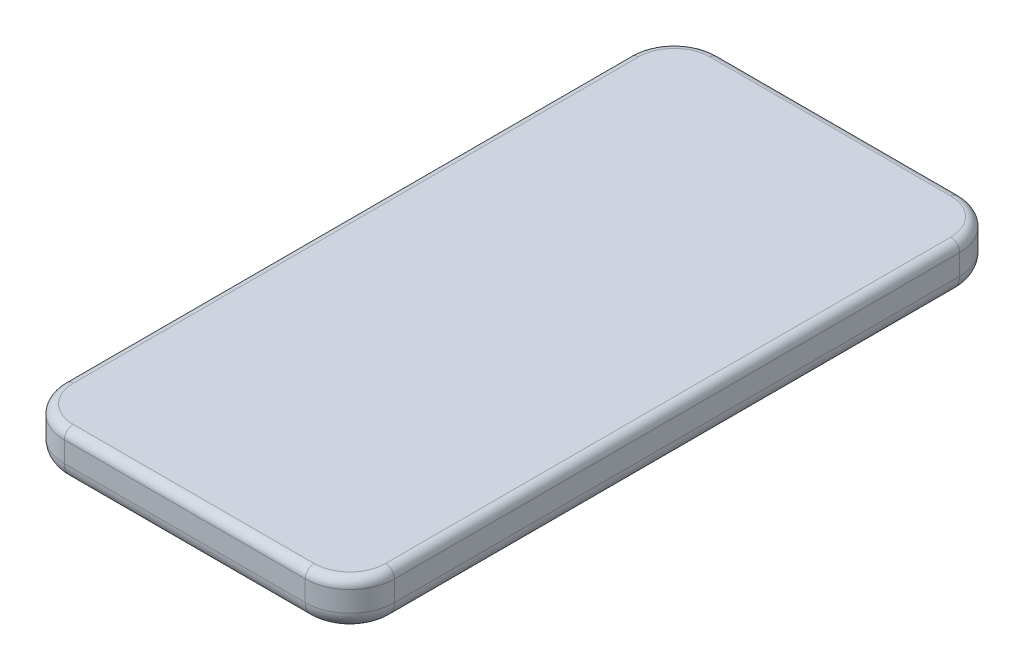
ISO-10303-21;
HEADER;
FILE_DESCRIPTION(('STEP AP214'),'2;1');
FILE_NAME('part.step','',(''),(''),'','','');
FILE_SCHEMA(('AUTOMOTIVE_DESIGN { 1 0 10303 214 1 1 1 1 }'));
ENDSEC;
DATA;
#1=APPLICATION_CONTEXT('core data for automotive mechanical design processes');
#2=APPLICATION_PROTOCOL_DEFINITION('international standard','automotive_design',2000,#1);
#3=PRODUCT_CONTEXT('',#1,'mechanical');
#4=PRODUCT('Part','Part','',(#3));
#5=PRODUCT_RELATED_PRODUCT_CATEGORY('part','',(#4));
#6=PRODUCT_DEFINITION_FORMATION('','',#4);
#7=PRODUCT_DEFINITION_CONTEXT('part definition',#1,'design');
#8=PRODUCT_DEFINITION('design','',#6,#7);
#9=PRODUCT_DEFINITION_SHAPE('','',#8);
#10=(LENGTH_UNIT() NAMED_UNIT(*) SI_UNIT(.MILLI.,.METRE.));
#11=(NAMED_UNIT(*) PLANE_ANGLE_UNIT() SI_UNIT($,.RADIAN.));
#12=(NAMED_UNIT(*) SI_UNIT($,.STERADIAN.) SOLID_ANGLE_UNIT());
#13=UNCERTAINTY_MEASURE_WITH_UNIT(LENGTH_MEASURE(1.E-05),#10,'distance_accuracy_value','');
#14=(GEOMETRIC_REPRESENTATION_CONTEXT(3) GLOBAL_UNCERTAINTY_ASSIGNED_CONTEXT((#13)) GLOBAL_UNIT_ASSIGNED_CONTEXT((#10,
#11,#12)) REPRESENTATION_CONTEXT('',''));
#15=CARTESIAN_POINT('',(0.,0.,0.));
#16=DIRECTION('',(0.,0.,1.));
#17=DIRECTION('',(1.,0.,0.));
#18=AXIS2_PLACEMENT_3D('',#15,#16,#17);
#19=CARTESIAN_POINT('',(-37.,10.6,146.7));
#20=DIRECTION('',(1.,0.,0.));
#21=DIRECTION('',(0.,0.,-1.));
#22=AXIS2_PLACEMENT_3D('',#19,#20,#21);
#23=PLANE('',#22);
#24=DIRECTION('',(0.,-1.,0.));
#25=VECTOR('',#24,1.);
#26=CARTESIAN_POINT('',(-37.,10.6,136.7));
#27=LINE('',#26,#25);
#28=CARTESIAN_POINT('',(-37.,4.,136.7));
#29=VERTEX_POINT('',#28);
#30=CARTESIAN_POINT('',(-37.,8.6,136.7));
#31=VERTEX_POINT('',#30);
#32=EDGE_CURVE('E307',#29,#31,#27,.F.);
#33=ORIENTED_EDGE('',*,*,#32,.T.);
#34=DIRECTION('',(0.,0.,1.));
#35=VECTOR('',#34,1.);
#36=CARTESIAN_POINT('',(-37.,8.6,146.7));
#37=LINE('',#36,#35);
#38=CARTESIAN_POINT('',(-37.,8.6,10.));
#39=VERTEX_POINT('',#38);
#40=EDGE_CURVE('E247',#31,#39,#37,.F.);
#41=ORIENTED_EDGE('',*,*,#40,.T.);
#42=DIRECTION('',(0.,-1.,0.));
#43=VECTOR('',#42,1.);
#44=CARTESIAN_POINT('',(-37.,10.6,10.));
#45=LINE('',#44,#43);
#46=CARTESIAN_POINT('',(-37.,4.,10.));
#47=VERTEX_POINT('',#46);
#48=EDGE_CURVE('E305',#39,#47,#45,.T.);
#49=ORIENTED_EDGE('',*,*,#48,.T.);
#50=DIRECTION('',(0.,0.,1.));
#51=VECTOR('',#50,1.);
#52=CARTESIAN_POINT('',(-37.,4.,136.7));
#53=LINE('',#52,#51);
#54=EDGE_CURVE('E212',#47,#29,#53,.T.);
#55=ORIENTED_EDGE('',*,*,#54,.T.);
#56=EDGE_LOOP('',(#33,#41,#49,#55));
#57=FACE_BOUND('',#56,.T.);
#58=ADVANCED_FACE('F36',(#57),#23,.F.);
#59=CARTESIAN_POINT('',(37.,10.6,146.7));
#60=DIRECTION('',(0.,0.,-1.));
#61=DIRECTION('',(-1.,0.,0.));
#62=AXIS2_PLACEMENT_3D('',#59,#60,#61);
#63=PLANE('',#62);
#64=DIRECTION('',(0.,-1.,0.));
#65=VECTOR('',#64,1.);
#66=CARTESIAN_POINT('',(27.,10.6,146.7));
#67=LINE('',#66,#65);
#68=CARTESIAN_POINT('',(27.,4.,146.7));
#69=VERTEX_POINT('',#68);
#70=CARTESIAN_POINT('',(27.,8.6,146.7));
#71=VERTEX_POINT('',#70);
#72=EDGE_CURVE('E300',#69,#71,#67,.F.);
#73=ORIENTED_EDGE('',*,*,#72,.T.);
#74=DIRECTION('',(1.,0.,0.));
#75=VECTOR('',#74,1.);
#76=CARTESIAN_POINT('',(37.,8.6,146.7));
#77=LINE('',#76,#75);
#78=CARTESIAN_POINT('',(-27.,8.6,146.7));
#79=VERTEX_POINT('',#78);
#80=EDGE_CURVE('E45',#71,#79,#77,.F.);
#81=ORIENTED_EDGE('',*,*,#80,.T.);
#82=DIRECTION('',(0.,-1.,0.));
#83=VECTOR('',#82,1.);
#84=CARTESIAN_POINT('',(-27.,10.6,146.7));
#85=LINE('',#84,#83);
#86=CARTESIAN_POINT('',(-27.,4.,146.7));
#87=VERTEX_POINT('',#86);
#88=EDGE_CURVE('E298',#79,#87,#85,.T.);
#89=ORIENTED_EDGE('',*,*,#88,.T.);
#90=DIRECTION('',(1.,0.,0.));
#91=VECTOR('',#90,1.);
#92=CARTESIAN_POINT('',(27.,4.,146.7));
#93=LINE('',#92,#91);
#94=EDGE_CURVE('E209',#87,#69,#93,.T.);
#95=ORIENTED_EDGE('',*,*,#94,.T.);
#96=EDGE_LOOP('',(#73,#81,#89,#95));
#97=FACE_BOUND('',#96,.T.);
#98=ADVANCED_FACE('F371',(#97),#63,.F.);
#99=CARTESIAN_POINT('',(37.,10.6,0.));
#100=DIRECTION('',(-1.,0.,0.));
#101=DIRECTION('',(0.,0.,1.));
#102=AXIS2_PLACEMENT_3D('',#99,#100,#101);
#103=PLANE('',#102);
#104=DIRECTION('',(0.,-1.,0.));
#105=VECTOR('',#104,1.);
#106=CARTESIAN_POINT('',(37.,10.6,10.));
#107=LINE('',#106,#105);
#108=CARTESIAN_POINT('',(37.,4.,10.));
#109=VERTEX_POINT('',#108);
#110=CARTESIAN_POINT('',(37.,8.6,10.));
#111=VERTEX_POINT('',#110);
#112=EDGE_CURVE('E230',#109,#111,#107,.F.);
#113=ORIENTED_EDGE('',*,*,#112,.T.);
#114=DIRECTION('',(0.,0.,-1.));
#115=VECTOR('',#114,1.);
#116=CARTESIAN_POINT('',(37.,8.6,0.));
#117=LINE('',#116,#115);
#118=CARTESIAN_POINT('',(37.,8.6,136.7));
#119=VERTEX_POINT('',#118);
#120=EDGE_CURVE('E256',#111,#119,#117,.F.);
#121=ORIENTED_EDGE('',*,*,#120,.T.);
#122=DIRECTION('',(0.,-1.,0.));
#123=VECTOR('',#122,1.);
#124=CARTESIAN_POINT('',(37.,10.6,136.7));
#125=LINE('',#124,#123);
#126=CARTESIAN_POINT('',(37.,4.,136.7));
#127=VERTEX_POINT('',#126);
#128=EDGE_CURVE('E293',#119,#127,#125,.T.);
#129=ORIENTED_EDGE('',*,*,#128,.T.);
#130=DIRECTION('',(0.,0.,-1.));
#131=VECTOR('',#130,1.);
#132=CARTESIAN_POINT('',(37.,4.,10.));
#133=LINE('',#132,#131);
#134=EDGE_CURVE('E204',#127,#109,#133,.T.);
#135=ORIENTED_EDGE('',*,*,#134,.T.);
#136=EDGE_LOOP('',(#113,#121,#129,#135));
#137=FACE_BOUND('',#136,.T.);
#138=ADVANCED_FACE('F292',(#137),#103,.F.);
#139=CARTESIAN_POINT('',(-37.,10.6,0.));
#140=DIRECTION('',(0.,0.,1.));
#141=DIRECTION('',(1.,0.,0.));
#142=AXIS2_PLACEMENT_3D('',#139,#140,#141);
#143=PLANE('',#142);
#144=DIRECTION('',(0.,-1.,0.));
#145=VECTOR('',#144,1.);
#146=CARTESIAN_POINT('',(-27.,10.6,0.));
#147=LINE('',#146,#145);
#148=CARTESIAN_POINT('',(-27.,4.,0.));
#149=VERTEX_POINT('',#148);
#150=CARTESIAN_POINT('',(-27.,8.6,0.));
#151=VERTEX_POINT('',#150);
#152=EDGE_CURVE('E178',#149,#151,#147,.F.);
#153=ORIENTED_EDGE('',*,*,#152,.T.);
#154=DIRECTION('',(-1.,0.,0.));
#155=VECTOR('',#154,1.);
#156=CARTESIAN_POINT('',(-37.,8.6,0.));
#157=LINE('',#156,#155);
#158=CARTESIAN_POINT('',(27.,8.6,0.));
#159=VERTEX_POINT('',#158);
#160=EDGE_CURVE('E252',#151,#159,#157,.F.);
#161=ORIENTED_EDGE('',*,*,#160,.T.);
#162=DIRECTION('',(0.,-1.,0.));
#163=VECTOR('',#162,1.);
#164=CARTESIAN_POINT('',(27.,10.6,0.));
#165=LINE('',#164,#163);
#166=CARTESIAN_POINT('',(27.,4.,0.));
#167=VERTEX_POINT('',#166);
#168=EDGE_CURVE('E181',#159,#167,#165,.T.);
#169=ORIENTED_EDGE('',*,*,#168,.T.);
#170=DIRECTION('',(-1.,0.,0.));
#171=VECTOR('',#170,1.);
#172=CARTESIAN_POINT('',(-27.,4.,0.));
#173=LINE('',#172,#171);
#174=EDGE_CURVE('E199',#167,#149,#173,.T.);
#175=ORIENTED_EDGE('',*,*,#174,.T.);
#176=EDGE_LOOP('',(#153,#161,#169,#175));
#177=FACE_BOUND('',#176,.T.);
#178=ADVANCED_FACE('F311',(#177),#143,.F.);
#179=CARTESIAN_POINT('',(0.,10.6,0.));
#180=DIRECTION('',(0.,-1.,0.));
#181=DIRECTION('',(0.,0.,-1.));
#182=AXIS2_PLACEMENT_3D('',#179,#180,#181);
#183=PLANE('',#182);
#184=CARTESIAN_POINT('',(-27.,10.6,10.));
#185=DIRECTION('',(0.,-1.,0.));
#186=DIRECTION('',(0.,0.,-1.));
#187=AXIS2_PLACEMENT_3D('',#184,#185,#186);
#188=CIRCLE('',#187,8.);
#189=CARTESIAN_POINT('',(-27.,10.6,2.));
#190=VERTEX_POINT('',#189);
#191=CARTESIAN_POINT('',(-35.,10.6,10.));
#192=VERTEX_POINT('',#191);
#193=EDGE_CURVE('E242',#190,#192,#188,.F.);
#194=ORIENTED_EDGE('',*,*,#193,.T.);
#195=DIRECTION('',(0.,0.,1.));
#196=VECTOR('',#195,1.);
#197=CARTESIAN_POINT('',(-35.,10.6,0.));
#198=LINE('',#197,#196);
#199=CARTESIAN_POINT('',(-35.,10.6,136.7));
#200=VERTEX_POINT('',#199);
#201=EDGE_CURVE('E244',#192,#200,#198,.T.);
#202=ORIENTED_EDGE('',*,*,#201,.T.);
#203=CARTESIAN_POINT('',(-27.,10.6,136.7));
#204=DIRECTION('',(0.,-1.,0.));
#205=DIRECTION('',(0.,0.,-1.));
#206=AXIS2_PLACEMENT_3D('',#203,#204,#205);
#207=CIRCLE('',#206,8.);
#208=CARTESIAN_POINT('',(-27.,10.6,144.7));
#209=VERTEX_POINT('',#208);
#210=EDGE_CURVE('E214',#200,#209,#207,.F.);
#211=ORIENTED_EDGE('',*,*,#210,.T.);
#212=DIRECTION('',(1.,0.,0.));
#213=VECTOR('',#212,1.);
#214=CARTESIAN_POINT('',(0.,10.6,144.7));
#215=LINE('',#214,#213);
#216=CARTESIAN_POINT('',(27.,10.6,144.7));
#217=VERTEX_POINT('',#216);
#218=EDGE_CURVE('E232',#209,#217,#215,.T.);
#219=ORIENTED_EDGE('',*,*,#218,.T.);
#220=CARTESIAN_POINT('',(27.,10.6,136.7));
#221=DIRECTION('',(0.,-1.,0.));
#222=DIRECTION('',(0.,0.,-1.));
#223=AXIS2_PLACEMENT_3D('',#220,#221,#222);
#224=CIRCLE('',#223,8.);
#225=CARTESIAN_POINT('',(35.,10.6,136.7));
#226=VERTEX_POINT('',#225);
#227=EDGE_CURVE('E234',#217,#226,#224,.F.);
#228=ORIENTED_EDGE('',*,*,#227,.T.);
#229=DIRECTION('',(0.,0.,-1.));
#230=VECTOR('',#229,1.);
#231=CARTESIAN_POINT('',(35.,10.6,0.));
#232=LINE('',#231,#230);
#233=CARTESIAN_POINT('',(35.,10.6,10.));
#234=VERTEX_POINT('',#233);
#235=EDGE_CURVE('E236',#226,#234,#232,.T.);
#236=ORIENTED_EDGE('',*,*,#235,.T.);
#237=CARTESIAN_POINT('',(27.,10.6,10.));
#238=DIRECTION('',(0.,-1.,0.));
#239=DIRECTION('',(0.,0.,-1.));
#240=AXIS2_PLACEMENT_3D('',#237,#238,#239);
#241=CIRCLE('',#240,8.);
#242=CARTESIAN_POINT('',(27.,10.6,2.));
#243=VERTEX_POINT('',#242);
#244=EDGE_CURVE('E238',#234,#243,#241,.F.);
#245=ORIENTED_EDGE('',*,*,#244,.T.);
#246=DIRECTION('',(-1.,0.,0.));
#247=VECTOR('',#246,1.);
#248=CARTESIAN_POINT('',(0.,10.6,2.));
#249=LINE('',#248,#247);
#250=EDGE_CURVE('E240',#243,#190,#249,.T.);
#251=ORIENTED_EDGE('',*,*,#250,.T.);
#252=EDGE_LOOP('',(#194,#202,#211,#219,#228,#236,#245,#251));
#253=FACE_BOUND('',#252,.T.);
#254=ADVANCED_FACE('F344',(#253),#183,.F.);
#255=CARTESIAN_POINT('',(0.,0.,0.));
#256=DIRECTION('',(0.,-1.,0.));
#257=DIRECTION('',(0.,0.,-1.));
#258=AXIS2_PLACEMENT_3D('',#255,#256,#257);
#259=PLANE('',#258);
#260=DIRECTION('',(0.,0.,1.));
#261=VECTOR('',#260,1.);
#262=CARTESIAN_POINT('',(-33.,0.,10.));
#263=LINE('',#262,#261);
#264=CARTESIAN_POINT('',(-33.,0.,136.7));
#265=VERTEX_POINT('',#264);
#266=CARTESIAN_POINT('',(-33.,0.,10.));
#267=VERTEX_POINT('',#266);
#268=EDGE_CURVE('E155',#265,#267,#263,.F.);
#269=ORIENTED_EDGE('',*,*,#268,.T.);
#270=CARTESIAN_POINT('',(-27.,0.,10.));
#271=DIRECTION('',(0.,-1.,0.));
#272=DIRECTION('',(0.,0.,-1.));
#273=AXIS2_PLACEMENT_3D('',#270,#271,#272);
#274=CIRCLE('',#273,6.);
#275=CARTESIAN_POINT('',(-27.,0.,4.));
#276=VERTEX_POINT('',#275);
#277=EDGE_CURVE('E194',#267,#276,#274,.T.);
#278=ORIENTED_EDGE('',*,*,#277,.T.);
#279=DIRECTION('',(-1.,0.,0.));
#280=VECTOR('',#279,1.);
#281=CARTESIAN_POINT('',(27.,0.,4.));
#282=LINE('',#281,#280);
#283=CARTESIAN_POINT('',(27.,0.,4.));
#284=VERTEX_POINT('',#283);
#285=EDGE_CURVE('E192',#276,#284,#282,.F.);
#286=ORIENTED_EDGE('',*,*,#285,.T.);
#287=CARTESIAN_POINT('',(27.,0.,10.));
#288=DIRECTION('',(0.,-1.,0.));
#289=DIRECTION('',(0.,0.,-1.));
#290=AXIS2_PLACEMENT_3D('',#287,#288,#289);
#291=CIRCLE('',#290,6.);
#292=CARTESIAN_POINT('',(33.,0.,10.));
#293=VERTEX_POINT('',#292);
#294=EDGE_CURVE('E190',#284,#293,#291,.T.);
#295=ORIENTED_EDGE('',*,*,#294,.T.);
#296=DIRECTION('',(0.,0.,-1.));
#297=VECTOR('',#296,1.);
#298=CARTESIAN_POINT('',(33.,0.,136.7));
#299=LINE('',#298,#297);
#300=CARTESIAN_POINT('',(33.,0.,136.7));
#301=VERTEX_POINT('',#300);
#302=EDGE_CURVE('E188',#293,#301,#299,.F.);
#303=ORIENTED_EDGE('',*,*,#302,.T.);
#304=CARTESIAN_POINT('',(27.,0.,136.7));
#305=DIRECTION('',(0.,-1.,0.));
#306=DIRECTION('',(0.,0.,-1.));
#307=AXIS2_PLACEMENT_3D('',#304,#305,#306);
#308=CIRCLE('',#307,6.);
#309=CARTESIAN_POINT('',(27.,0.,142.7));
#310=VERTEX_POINT('',#309);
#311=EDGE_CURVE('E186',#301,#310,#308,.T.);
#312=ORIENTED_EDGE('',*,*,#311,.T.);
#313=DIRECTION('',(1.,0.,0.));
#314=VECTOR('',#313,1.);
#315=CARTESIAN_POINT('',(-27.,0.,142.7));
#316=LINE('',#315,#314);
#317=CARTESIAN_POINT('',(-27.,0.,142.7));
#318=VERTEX_POINT('',#317);
#319=EDGE_CURVE('E158',#310,#318,#316,.F.);
#320=ORIENTED_EDGE('',*,*,#319,.T.);
#321=CARTESIAN_POINT('',(-27.,0.,136.7));
#322=DIRECTION('',(0.,-1.,0.));
#323=DIRECTION('',(0.,0.,-1.));
#324=AXIS2_PLACEMENT_3D('',#321,#322,#323);
#325=CIRCLE('',#324,6.);
#326=EDGE_CURVE('E150',#318,#265,#325,.T.);
#327=ORIENTED_EDGE('',*,*,#326,.T.);
#328=EDGE_LOOP('',(#269,#278,#286,#295,#303,#312,#320,#327));
#329=FACE_BOUND('',#328,.T.);
#330=ADVANCED_FACE('F152',(#329),#259,.T.);
#331=CARTESIAN_POINT('',(27.,10.6,136.7));
#332=DIRECTION('',(0.,-1.,0.));
#333=DIRECTION('',(0.,0.,-1.));
#334=AXIS2_PLACEMENT_3D('',#331,#332,#333);
#335=CYLINDRICAL_SURFACE('',#334,10.);
#336=ORIENTED_EDGE('',*,*,#128,.F.);
#337=CARTESIAN_POINT('',(27.,8.6,136.7));
#338=DIRECTION('',(0.,-1.,0.));
#339=DIRECTION('',(0.,0.,-1.));
#340=AXIS2_PLACEMENT_3D('',#337,#338,#339);
#341=CIRCLE('',#340,10.);
#342=EDGE_CURVE('E60',#119,#71,#341,.T.);
#343=ORIENTED_EDGE('',*,*,#342,.T.);
#344=ORIENTED_EDGE('',*,*,#72,.F.);
#345=CARTESIAN_POINT('',(27.,4.,136.7));
#346=DIRECTION('',(0.,-1.,0.));
#347=DIRECTION('',(0.,0.,-1.));
#348=AXIS2_PLACEMENT_3D('',#345,#346,#347);
#349=CIRCLE('',#348,10.);
#350=EDGE_CURVE('E206',#69,#127,#349,.F.);
#351=ORIENTED_EDGE('',*,*,#350,.T.);
#352=EDGE_LOOP('',(#336,#343,#344,#351));
#353=FACE_BOUND('',#352,.T.);
#354=ADVANCED_FACE('F295',(#353),#335,.T.);
#355=CARTESIAN_POINT('',(-27.,10.6,136.7));
#356=DIRECTION('',(0.,-1.,0.));
#357=DIRECTION('',(0.,0.,-1.));
#358=AXIS2_PLACEMENT_3D('',#355,#356,#357);
#359=CYLINDRICAL_SURFACE('',#358,10.);
#360=ORIENTED_EDGE('',*,*,#88,.F.);
#361=CARTESIAN_POINT('',(-27.,8.6,136.7));
#362=DIRECTION('',(0.,-1.,0.));
#363=DIRECTION('',(0.,0.,-1.));
#364=AXIS2_PLACEMENT_3D('',#361,#362,#363);
#365=CIRCLE('',#364,10.);
#366=EDGE_CURVE('E11',#79,#31,#365,.T.);
#367=ORIENTED_EDGE('',*,*,#366,.T.);
#368=ORIENTED_EDGE('',*,*,#32,.F.);
#369=CARTESIAN_POINT('',(-27.,4.,136.7));
#370=DIRECTION('',(0.,-1.,0.));
#371=DIRECTION('',(0.,0.,-1.));
#372=AXIS2_PLACEMENT_3D('',#369,#370,#371);
#373=CIRCLE('',#372,10.);
#374=EDGE_CURVE('E168',#29,#87,#373,.F.);
#375=ORIENTED_EDGE('',*,*,#374,.T.);
#376=EDGE_LOOP('',(#360,#367,#368,#375));
#377=FACE_BOUND('',#376,.T.);
#378=ADVANCED_FACE('F358',(#377),#359,.T.);
#379=CARTESIAN_POINT('',(-27.,10.6,10.));
#380=DIRECTION('',(0.,-1.,0.));
#381=DIRECTION('',(0.,0.,-1.));
#382=AXIS2_PLACEMENT_3D('',#379,#380,#381);
#383=CYLINDRICAL_SURFACE('',#382,10.);
#384=ORIENTED_EDGE('',*,*,#48,.F.);
#385=CARTESIAN_POINT('',(-27.,8.6,10.));
#386=DIRECTION('',(0.,-1.,0.));
#387=DIRECTION('',(0.,0.,-1.));
#388=AXIS2_PLACEMENT_3D('',#385,#386,#387);
#389=CIRCLE('',#388,10.);
#390=EDGE_CURVE('E250',#39,#151,#389,.T.);
#391=ORIENTED_EDGE('',*,*,#390,.T.);
#392=ORIENTED_EDGE('',*,*,#152,.F.);
#393=CARTESIAN_POINT('',(-27.,4.,10.));
#394=DIRECTION('',(0.,-1.,0.));
#395=DIRECTION('',(0.,0.,-1.));
#396=AXIS2_PLACEMENT_3D('',#393,#394,#395);
#397=CIRCLE('',#396,10.);
#398=EDGE_CURVE('E196',#149,#47,#397,.F.);
#399=ORIENTED_EDGE('',*,*,#398,.T.);
#400=EDGE_LOOP('',(#384,#391,#392,#399));
#401=FACE_BOUND('',#400,.T.);
#402=ADVANCED_FACE('F332',(#401),#383,.T.);
#403=CARTESIAN_POINT('',(27.,10.6,10.));
#404=DIRECTION('',(0.,-1.,0.));
#405=DIRECTION('',(0.,0.,-1.));
#406=AXIS2_PLACEMENT_3D('',#403,#404,#405);
#407=CYLINDRICAL_SURFACE('',#406,10.);
#408=ORIENTED_EDGE('',*,*,#168,.F.);
#409=CARTESIAN_POINT('',(27.,8.6,10.));
#410=DIRECTION('',(0.,-1.,0.));
#411=DIRECTION('',(0.,0.,-1.));
#412=AXIS2_PLACEMENT_3D('',#409,#410,#411);
#413=CIRCLE('',#412,10.);
#414=EDGE_CURVE('E254',#159,#111,#413,.T.);
#415=ORIENTED_EDGE('',*,*,#414,.T.);
#416=ORIENTED_EDGE('',*,*,#112,.F.);
#417=CARTESIAN_POINT('',(27.,4.,10.));
#418=DIRECTION('',(0.,-1.,0.));
#419=DIRECTION('',(0.,0.,-1.));
#420=AXIS2_PLACEMENT_3D('',#417,#418,#419);
#421=CIRCLE('',#420,10.);
#422=EDGE_CURVE('E201',#109,#167,#421,.F.);
#423=ORIENTED_EDGE('',*,*,#422,.T.);
#424=EDGE_LOOP('',(#408,#415,#416,#423));
#425=FACE_BOUND('',#424,.T.);
#426=ADVANCED_FACE('F318',(#425),#407,.T.);
#427=CARTESIAN_POINT('',(27.,4.,136.7));
#428=DIRECTION('',(0.,-1.,0.));
#429=DIRECTION('',(0.,0.,-1.));
#430=AXIS2_PLACEMENT_3D('',#427,#428,#429);
#431=TOROIDAL_SURFACE('',#430,6.,4.);
#432=CARTESIAN_POINT('',(33.,4.,136.7));
#433=DIRECTION('',(0.,0.,-1.));
#434=DIRECTION('',(-1.,0.,0.));
#435=AXIS2_PLACEMENT_3D('',#432,#433,#434);
#436=CIRCLE('',#435,4.);
#437=EDGE_CURVE('E224',#127,#301,#436,.T.);
#438=ORIENTED_EDGE('',*,*,#437,.F.);
#439=ORIENTED_EDGE('',*,*,#350,.F.);
#440=CARTESIAN_POINT('',(27.,4.,142.7));
#441=DIRECTION('',(-1.,0.,0.));
#442=DIRECTION('',(0.,0.,1.));
#443=AXIS2_PLACEMENT_3D('',#440,#441,#442);
#444=CIRCLE('',#443,4.);
#445=EDGE_CURVE('E227',#310,#69,#444,.T.);
#446=ORIENTED_EDGE('',*,*,#445,.F.);
#447=ORIENTED_EDGE('',*,*,#311,.F.);
#448=EDGE_LOOP('',(#438,#439,#446,#447));
#449=FACE_BOUND('',#448,.T.);
#450=ADVANCED_FACE('F387',(#449),#431,.T.);
#451=CARTESIAN_POINT('',(37.,4.,142.7));
#452=DIRECTION('',(-1.,0.,0.));
#453=DIRECTION('',(0.,0.,1.));
#454=AXIS2_PLACEMENT_3D('',#451,#452,#453);
#455=CYLINDRICAL_SURFACE('',#454,4.);
#456=ORIENTED_EDGE('',*,*,#445,.T.);
#457=ORIENTED_EDGE('',*,*,#94,.F.);
#458=CARTESIAN_POINT('',(-27.,4.,142.7));
#459=DIRECTION('',(-1.,0.,0.));
#460=DIRECTION('',(0.,0.,1.));
#461=AXIS2_PLACEMENT_3D('',#458,#459,#460);
#462=CIRCLE('',#461,4.);
#463=EDGE_CURVE('E222',#318,#87,#462,.T.);
#464=ORIENTED_EDGE('',*,*,#463,.F.);
#465=ORIENTED_EDGE('',*,*,#319,.F.);
#466=EDGE_LOOP('',(#456,#457,#464,#465));
#467=FACE_BOUND('',#466,.T.);
#468=ADVANCED_FACE('F401',(#467),#455,.T.);
#469=CARTESIAN_POINT('',(33.,4.,0.));
#470=DIRECTION('',(0.,0.,1.));
#471=DIRECTION('',(1.,0.,0.));
#472=AXIS2_PLACEMENT_3D('',#469,#470,#471);
#473=CYLINDRICAL_SURFACE('',#472,4.);
#474=ORIENTED_EDGE('',*,*,#437,.T.);
#475=ORIENTED_EDGE('',*,*,#302,.F.);
#476=CARTESIAN_POINT('',(33.,4.,10.));
#477=DIRECTION('',(0.,0.,-1.));
#478=DIRECTION('',(-1.,0.,0.));
#479=AXIS2_PLACEMENT_3D('',#476,#477,#478);
#480=CIRCLE('',#479,4.);
#481=EDGE_CURVE('E171',#109,#293,#480,.T.);
#482=ORIENTED_EDGE('',*,*,#481,.F.);
#483=ORIENTED_EDGE('',*,*,#134,.F.);
#484=EDGE_LOOP('',(#474,#475,#482,#483));
#485=FACE_BOUND('',#484,.T.);
#486=ADVANCED_FACE('F398',(#485),#473,.T.);
#487=CARTESIAN_POINT('',(-27.,4.,136.7));
#488=DIRECTION('',(0.,-1.,0.));
#489=DIRECTION('',(0.,0.,-1.));
#490=AXIS2_PLACEMENT_3D('',#487,#488,#489);
#491=TOROIDAL_SURFACE('',#490,6.,4.);
#492=ORIENTED_EDGE('',*,*,#463,.T.);
#493=ORIENTED_EDGE('',*,*,#374,.F.);
#494=CARTESIAN_POINT('',(-33.,4.,136.7));
#495=DIRECTION('',(0.,0.,-1.));
#496=DIRECTION('',(-1.,0.,0.));
#497=AXIS2_PLACEMENT_3D('',#494,#495,#496);
#498=CIRCLE('',#497,4.);
#499=EDGE_CURVE('E165',#265,#29,#498,.T.);
#500=ORIENTED_EDGE('',*,*,#499,.F.);
#501=ORIENTED_EDGE('',*,*,#326,.F.);
#502=EDGE_LOOP('',(#492,#493,#500,#501));
#503=FACE_BOUND('',#502,.T.);
#504=ADVANCED_FACE('F166',(#503),#491,.T.);
#505=CARTESIAN_POINT('',(27.,4.,10.));
#506=DIRECTION('',(0.,-1.,0.));
#507=DIRECTION('',(0.,0.,-1.));
#508=AXIS2_PLACEMENT_3D('',#505,#506,#507);
#509=TOROIDAL_SURFACE('',#508,6.,4.);
#510=ORIENTED_EDGE('',*,*,#481,.T.);
#511=ORIENTED_EDGE('',*,*,#294,.F.);
#512=CARTESIAN_POINT('',(27.,4.,4.));
#513=DIRECTION('',(-1.,0.,0.));
#514=DIRECTION('',(0.,0.,1.));
#515=AXIS2_PLACEMENT_3D('',#512,#513,#514);
#516=CIRCLE('',#515,4.);
#517=EDGE_CURVE('E172',#167,#284,#516,.T.);
#518=ORIENTED_EDGE('',*,*,#517,.F.);
#519=ORIENTED_EDGE('',*,*,#422,.F.);
#520=EDGE_LOOP('',(#510,#511,#518,#519));
#521=FACE_BOUND('',#520,.T.);
#522=ADVANCED_FACE('F322',(#521),#509,.T.);
#523=CARTESIAN_POINT('',(-33.,4.,146.7));
#524=DIRECTION('',(0.,0.,-1.));
#525=DIRECTION('',(-1.,0.,0.));
#526=AXIS2_PLACEMENT_3D('',#523,#524,#525);
#527=CYLINDRICAL_SURFACE('',#526,4.);
#528=ORIENTED_EDGE('',*,*,#499,.T.);
#529=ORIENTED_EDGE('',*,*,#54,.F.);
#530=CARTESIAN_POINT('',(-33.,4.,10.));
#531=DIRECTION('',(0.,0.,-1.));
#532=DIRECTION('',(-1.,0.,0.));
#533=AXIS2_PLACEMENT_3D('',#530,#531,#532);
#534=CIRCLE('',#533,4.);
#535=EDGE_CURVE('E176',#267,#47,#534,.T.);
#536=ORIENTED_EDGE('',*,*,#535,.F.);
#537=ORIENTED_EDGE('',*,*,#268,.F.);
#538=EDGE_LOOP('',(#528,#529,#536,#537));
#539=FACE_BOUND('',#538,.T.);
#540=ADVANCED_FACE('F174',(#539),#527,.T.);
#541=CARTESIAN_POINT('',(-37.,4.,4.));
#542=DIRECTION('',(1.,0.,0.));
#543=DIRECTION('',(0.,0.,-1.));
#544=AXIS2_PLACEMENT_3D('',#541,#542,#543);
#545=CYLINDRICAL_SURFACE('',#544,4.);
#546=ORIENTED_EDGE('',*,*,#517,.T.);
#547=ORIENTED_EDGE('',*,*,#285,.F.);
#548=CARTESIAN_POINT('',(-27.,4.,4.));
#549=DIRECTION('',(-1.,0.,0.));
#550=DIRECTION('',(0.,0.,1.));
#551=AXIS2_PLACEMENT_3D('',#548,#549,#550);
#552=CIRCLE('',#551,4.);
#553=EDGE_CURVE('E215',#149,#276,#552,.T.);
#554=ORIENTED_EDGE('',*,*,#553,.F.);
#555=ORIENTED_EDGE('',*,*,#174,.F.);
#556=EDGE_LOOP('',(#546,#547,#554,#555));
#557=FACE_BOUND('',#556,.T.);
#558=ADVANCED_FACE('F326',(#557),#545,.T.);
#559=CARTESIAN_POINT('',(-27.,4.,10.));
#560=DIRECTION('',(0.,-1.,0.));
#561=DIRECTION('',(0.,0.,-1.));
#562=AXIS2_PLACEMENT_3D('',#559,#560,#561);
#563=TOROIDAL_SURFACE('',#562,6.,4.);
#564=ORIENTED_EDGE('',*,*,#535,.T.);
#565=ORIENTED_EDGE('',*,*,#398,.F.);
#566=ORIENTED_EDGE('',*,*,#553,.T.);
#567=ORIENTED_EDGE('',*,*,#277,.F.);
#568=EDGE_LOOP('',(#564,#565,#566,#567));
#569=FACE_BOUND('',#568,.T.);
#570=ADVANCED_FACE('F329',(#569),#563,.T.);
#571=CARTESIAN_POINT('',(35.,8.6,0.));
#572=DIRECTION('',(0.,0.,-1.));
#573=DIRECTION('',(-1.,0.,0.));
#574=AXIS2_PLACEMENT_3D('',#571,#572,#573);
#575=CYLINDRICAL_SURFACE('',#574,2.);
#576=CARTESIAN_POINT('',(35.,8.6,136.7));
#577=DIRECTION('',(0.,0.,1.));
#578=DIRECTION('',(1.,0.,0.));
#579=AXIS2_PLACEMENT_3D('',#576,#577,#578);
#580=CIRCLE('',#579,2.);
#581=EDGE_CURVE('E275',#119,#226,#580,.T.);
#582=ORIENTED_EDGE('',*,*,#581,.F.);
#583=ORIENTED_EDGE('',*,*,#120,.F.);
#584=CARTESIAN_POINT('',(35.,8.6,10.));
#585=DIRECTION('',(0.,0.,-1.));
#586=DIRECTION('',(-1.,0.,0.));
#587=AXIS2_PLACEMENT_3D('',#584,#585,#586);
#588=CIRCLE('',#587,2.);
#589=EDGE_CURVE('E40',#234,#111,#588,.T.);
#590=ORIENTED_EDGE('',*,*,#589,.F.);
#591=ORIENTED_EDGE('',*,*,#235,.F.);
#592=EDGE_LOOP('',(#582,#583,#590,#591));
#593=FACE_BOUND('',#592,.T.);
#594=ADVANCED_FACE('F38',(#593),#575,.T.);
#595=CARTESIAN_POINT('',(27.,8.6,10.));
#596=DIRECTION('',(0.,-1.,0.));
#597=DIRECTION('',(0.,0.,-1.));
#598=AXIS2_PLACEMENT_3D('',#595,#596,#597);
#599=TOROIDAL_SURFACE('',#598,8.,2.);
#600=ORIENTED_EDGE('',*,*,#589,.T.);
#601=ORIENTED_EDGE('',*,*,#414,.F.);
#602=CARTESIAN_POINT('',(27.,8.6,2.));
#603=DIRECTION('',(-1.,0.,0.));
#604=DIRECTION('',(0.,0.,1.));
#605=AXIS2_PLACEMENT_3D('',#602,#603,#604);
#606=CIRCLE('',#605,2.);
#607=EDGE_CURVE('E273',#243,#159,#606,.T.);
#608=ORIENTED_EDGE('',*,*,#607,.F.);
#609=ORIENTED_EDGE('',*,*,#244,.F.);
#610=EDGE_LOOP('',(#600,#601,#608,#609));
#611=FACE_BOUND('',#610,.T.);
#612=ADVANCED_FACE('F285',(#611),#599,.T.);
#613=CARTESIAN_POINT('',(27.,8.6,136.7));
#614=DIRECTION('',(0.,-1.,0.));
#615=DIRECTION('',(0.,0.,-1.));
#616=AXIS2_PLACEMENT_3D('',#613,#614,#615);
#617=TOROIDAL_SURFACE('',#616,8.,2.);
#618=ORIENTED_EDGE('',*,*,#581,.T.);
#619=ORIENTED_EDGE('',*,*,#227,.F.);
#620=CARTESIAN_POINT('',(27.,8.6,144.7));
#621=DIRECTION('',(-1.,0.,0.));
#622=DIRECTION('',(0.,0.,1.));
#623=AXIS2_PLACEMENT_3D('',#620,#621,#622);
#624=CIRCLE('',#623,2.);
#625=EDGE_CURVE('E270',#71,#217,#624,.T.);
#626=ORIENTED_EDGE('',*,*,#625,.F.);
#627=ORIENTED_EDGE('',*,*,#342,.F.);
#628=EDGE_LOOP('',(#618,#619,#626,#627));
#629=FACE_BOUND('',#628,.T.);
#630=ADVANCED_FACE('F347',(#629),#617,.T.);
#631=CARTESIAN_POINT('',(0.,8.6,2.));
#632=DIRECTION('',(-1.,0.,0.));
#633=DIRECTION('',(0.,0.,1.));
#634=AXIS2_PLACEMENT_3D('',#631,#632,#633);
#635=CYLINDRICAL_SURFACE('',#634,2.);
#636=ORIENTED_EDGE('',*,*,#607,.T.);
#637=ORIENTED_EDGE('',*,*,#160,.F.);
#638=CARTESIAN_POINT('',(-27.,8.6,2.));
#639=DIRECTION('',(-1.,0.,0.));
#640=DIRECTION('',(0.,0.,1.));
#641=AXIS2_PLACEMENT_3D('',#638,#639,#640);
#642=CIRCLE('',#641,2.);
#643=EDGE_CURVE('E267',#190,#151,#642,.T.);
#644=ORIENTED_EDGE('',*,*,#643,.F.);
#645=ORIENTED_EDGE('',*,*,#250,.F.);
#646=EDGE_LOOP('',(#636,#637,#644,#645));
#647=FACE_BOUND('',#646,.T.);
#648=ADVANCED_FACE('F336',(#647),#635,.T.);
#649=CARTESIAN_POINT('',(0.,8.6,144.7));
#650=DIRECTION('',(1.,0.,0.));
#651=DIRECTION('',(0.,0.,-1.));
#652=AXIS2_PLACEMENT_3D('',#649,#650,#651);
#653=CYLINDRICAL_SURFACE('',#652,2.);
#654=ORIENTED_EDGE('',*,*,#625,.T.);
#655=ORIENTED_EDGE('',*,*,#218,.F.);
#656=CARTESIAN_POINT('',(-27.,8.6,144.7));
#657=DIRECTION('',(-1.,0.,0.));
#658=DIRECTION('',(0.,0.,1.));
#659=AXIS2_PLACEMENT_3D('',#656,#657,#658);
#660=CIRCLE('',#659,2.);
#661=EDGE_CURVE('E264',#79,#209,#660,.T.);
#662=ORIENTED_EDGE('',*,*,#661,.F.);
#663=ORIENTED_EDGE('',*,*,#80,.F.);
#664=EDGE_LOOP('',(#654,#655,#662,#663));
#665=FACE_BOUND('',#664,.T.);
#666=ADVANCED_FACE('F349',(#665),#653,.T.);
#667=CARTESIAN_POINT('',(-27.,8.6,10.));
#668=DIRECTION('',(0.,-1.,0.));
#669=DIRECTION('',(0.,0.,-1.));
#670=AXIS2_PLACEMENT_3D('',#667,#668,#669);
#671=TOROIDAL_SURFACE('',#670,8.,2.);
#672=ORIENTED_EDGE('',*,*,#643,.T.);
#673=ORIENTED_EDGE('',*,*,#390,.F.);
#674=CARTESIAN_POINT('',(-35.,8.6,10.));
#675=DIRECTION('',(0.,0.,1.));
#676=DIRECTION('',(1.,0.,0.));
#677=AXIS2_PLACEMENT_3D('',#674,#675,#676);
#678=CIRCLE('',#677,2.);
#679=EDGE_CURVE('E262',#192,#39,#678,.T.);
#680=ORIENTED_EDGE('',*,*,#679,.F.);
#681=ORIENTED_EDGE('',*,*,#193,.F.);
#682=EDGE_LOOP('',(#672,#673,#680,#681));
#683=FACE_BOUND('',#682,.T.);
#684=ADVANCED_FACE('F340',(#683),#671,.T.);
#685=CARTESIAN_POINT('',(-27.,8.6,136.7));
#686=DIRECTION('',(0.,-1.,0.));
#687=DIRECTION('',(0.,0.,-1.));
#688=AXIS2_PLACEMENT_3D('',#685,#686,#687);
#689=TOROIDAL_SURFACE('',#688,8.,2.);
#690=ORIENTED_EDGE('',*,*,#661,.T.);
#691=ORIENTED_EDGE('',*,*,#210,.F.);
#692=CARTESIAN_POINT('',(-35.,8.6,136.7));
#693=DIRECTION('',(0.,0.,-1.));
#694=DIRECTION('',(-1.,0.,0.));
#695=AXIS2_PLACEMENT_3D('',#692,#693,#694);
#696=CIRCLE('',#695,2.);
#697=EDGE_CURVE('E260',#31,#200,#696,.T.);
#698=ORIENTED_EDGE('',*,*,#697,.F.);
#699=ORIENTED_EDGE('',*,*,#366,.F.);
#700=EDGE_LOOP('',(#690,#691,#698,#699));
#701=FACE_BOUND('',#700,.T.);
#702=ADVANCED_FACE('F355',(#701),#689,.T.);
#703=CARTESIAN_POINT('',(-35.,8.6,0.));
#704=DIRECTION('',(0.,0.,1.));
#705=DIRECTION('',(1.,0.,0.));
#706=AXIS2_PLACEMENT_3D('',#703,#704,#705);
#707=CYLINDRICAL_SURFACE('',#706,2.);
#708=ORIENTED_EDGE('',*,*,#679,.T.);
#709=ORIENTED_EDGE('',*,*,#40,.F.);
#710=ORIENTED_EDGE('',*,*,#697,.T.);
#711=ORIENTED_EDGE('',*,*,#201,.F.);
#712=EDGE_LOOP('',(#708,#709,#710,#711));
#713=FACE_BOUND('',#712,.T.);
#714=ADVANCED_FACE('F362',(#713),#707,.T.);
#715=CLOSED_SHELL('',(#58,#98,#138,#178,#254,#330,#354,#378,#402,#426,#450,#468,#486,#504,#522,
#540,#558,#570,#594,#612,#630,#648,#666,#684,#702,#714));
#716=MANIFOLD_SOLID_BREP('B2',#715);
#717=ADVANCED_BREP_SHAPE_REPRESENTATION('',(#18,#716),#14);
#718=SHAPE_DEFINITION_REPRESENTATION(#9,#717);
ENDSEC;
END-ISO-10303-21;
